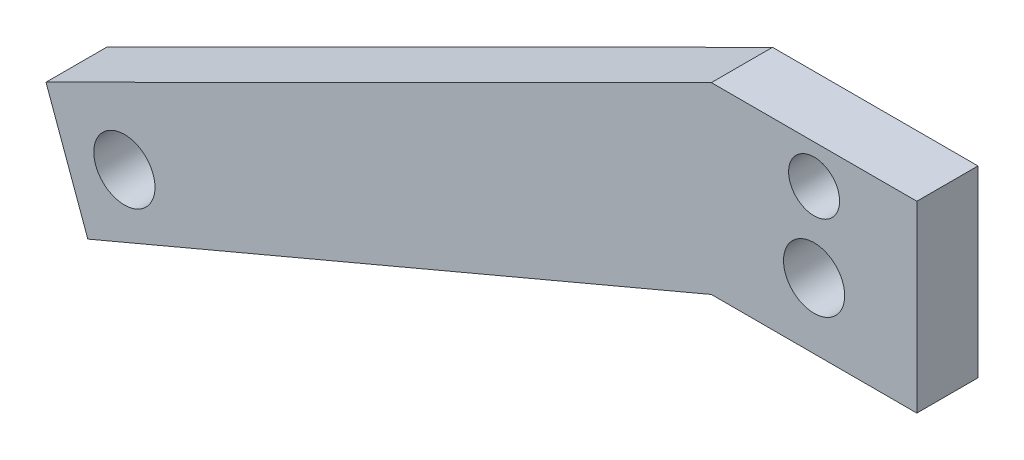
ISO-10303-21;
HEADER;
FILE_DESCRIPTION(('STEP AP214'),'2;1');
FILE_NAME('part.step','',(''),(''),'','','');
FILE_SCHEMA(('AUTOMOTIVE_DESIGN { 1 0 10303 214 1 1 1 1 }'));
ENDSEC;
DATA;
#1=APPLICATION_CONTEXT('core data for automotive mechanical design processes');
#2=APPLICATION_PROTOCOL_DEFINITION('international standard','automotive_design',2000,#1);
#3=PRODUCT_CONTEXT('',#1,'mechanical');
#4=PRODUCT('Part','Part','',(#3));
#5=PRODUCT_RELATED_PRODUCT_CATEGORY('part','',(#4));
#6=PRODUCT_DEFINITION_FORMATION('','',#4);
#7=PRODUCT_DEFINITION_CONTEXT('part definition',#1,'design');
#8=PRODUCT_DEFINITION('design','',#6,#7);
#9=PRODUCT_DEFINITION_SHAPE('','',#8);
#10=(LENGTH_UNIT() NAMED_UNIT(*) SI_UNIT(.MILLI.,.METRE.));
#11=(NAMED_UNIT(*) PLANE_ANGLE_UNIT() SI_UNIT($,.RADIAN.));
#12=(NAMED_UNIT(*) SI_UNIT($,.STERADIAN.) SOLID_ANGLE_UNIT());
#13=UNCERTAINTY_MEASURE_WITH_UNIT(LENGTH_MEASURE(1.E-05),#10,'distance_accuracy_value','');
#14=(GEOMETRIC_REPRESENTATION_CONTEXT(3) GLOBAL_UNCERTAINTY_ASSIGNED_CONTEXT((#13)) GLOBAL_UNIT_ASSIGNED_CONTEXT((#10,
#11,#12)) REPRESENTATION_CONTEXT('',''));
#15=CARTESIAN_POINT('',(0.,0.,0.));
#16=DIRECTION('',(0.,0.,1.));
#17=DIRECTION('',(1.,0.,0.));
#18=AXIS2_PLACEMENT_3D('',#15,#16,#17);
#19=CARTESIAN_POINT('',(-107.793068959156,-39.233468561337,9.525));
#20=DIRECTION('',(-0.939692620785908,-0.34202014332567,0.));
#21=DIRECTION('',(0.34202014332567,-0.939692620785908,0.));
#22=AXIS2_PLACEMENT_3D('',#19,#20,#21);
#23=PLANE('',#22);
#24=DIRECTION('',(-0.34202014332567,0.939692620785908,0.));
#25=VECTOR('',#24,1.);
#26=CARTESIAN_POINT('',(-107.793068959156,-39.233468561337,0.));
#27=LINE('',#26,#25);
#28=CARTESIAN_POINT('',(-113.099691567692,-24.6536427708158,0.));
#29=VERTEX_POINT('',#28);
#30=CARTESIAN_POINT('',(-119.615175298046,-6.75249834484423,0.));
#31=VERTEX_POINT('',#30);
#32=EDGE_CURVE('E144',#29,#31,#27,.T.);
#33=ORIENTED_EDGE('',*,*,#32,.F.);
#34=DIRECTION('',(0.,0.,-1.));
#35=VECTOR('',#34,1.);
#36=CARTESIAN_POINT('',(-113.099691567692,-24.6536427708158,9.525));
#37=LINE('',#36,#35);
#38=CARTESIAN_POINT('',(-113.099691567692,-24.6536427708158,9.525));
#39=VERTEX_POINT('',#38);
#40=EDGE_CURVE('E11',#39,#29,#37,.T.);
#41=ORIENTED_EDGE('',*,*,#40,.F.);
#42=DIRECTION('',(-0.34202014332567,0.939692620785908,0.));
#43=VECTOR('',#42,1.);
#44=CARTESIAN_POINT('',(-107.793068959156,-39.233468561337,9.525));
#45=LINE('',#44,#43);
#46=CARTESIAN_POINT('',(-119.615175298046,-6.75249834484423,9.525));
#47=VERTEX_POINT('',#46);
#48=EDGE_CURVE('E278',#39,#47,#45,.T.);
#49=ORIENTED_EDGE('',*,*,#48,.T.);
#50=DIRECTION('',(0.,0.,-1.));
#51=VECTOR('',#50,1.);
#52=CARTESIAN_POINT('',(-119.615175298046,-6.75249834484423,9.525));
#53=LINE('',#52,#51);
#54=EDGE_CURVE('E87',#47,#31,#53,.T.);
#55=ORIENTED_EDGE('',*,*,#54,.T.);
#56=EDGE_LOOP('',(#33,#41,#49,#55));
#57=FACE_BOUND('',#56,.T.);
#58=ADVANCED_FACE('F41',(#57),#23,.T.);
#59=CARTESIAN_POINT('',(-8.32273533976929,19.6728880173249,9.525));
#60=DIRECTION('',(0.389623727137633,-0.920974131695011,0.));
#61=DIRECTION('',(0.920974131695011,0.389623727137633,0.));
#62=AXIS2_PLACEMENT_3D('',#59,#60,#61);
#63=PLANE('',#62);
#64=DIRECTION('',(-0.920974131695011,-0.389623727137633,0.));
#65=VECTOR('',#64,1.);
#66=CARTESIAN_POINT('',(-8.32273533976929,19.6728880173249,0.));
#67=LINE('',#66,#65);
#68=CARTESIAN_POINT('',(-15.9999946271166,16.4249766213414,0.));
#69=VERTEX_POINT('',#68);
#70=EDGE_CURVE('E141',#69,#29,#67,.T.);
#71=ORIENTED_EDGE('',*,*,#70,.F.);
#72=DIRECTION('',(0.,0.,-1.));
#73=VECTOR('',#72,1.);
#74=CARTESIAN_POINT('',(-15.9999946271166,16.4249766213414,9.525));
#75=LINE('',#74,#73);
#76=CARTESIAN_POINT('',(-15.9999946271166,16.4249766213414,9.525));
#77=VERTEX_POINT('',#76);
#78=EDGE_CURVE('E51',#77,#69,#75,.T.);
#79=ORIENTED_EDGE('',*,*,#78,.F.);
#80=DIRECTION('',(-0.920974131695011,-0.389623727137633,0.));
#81=VECTOR('',#80,1.);
#82=CARTESIAN_POINT('',(-8.32273533976929,19.6728880173249,9.525));
#83=LINE('',#82,#81);
#84=EDGE_CURVE('E280',#77,#39,#83,.T.);
#85=ORIENTED_EDGE('',*,*,#84,.T.);
#86=ORIENTED_EDGE('',*,*,#40,.T.);
#87=EDGE_LOOP('',(#71,#79,#85,#86));
#88=FACE_BOUND('',#87,.T.);
#89=ADVANCED_FACE('F142',(#88),#63,.T.);
#90=CARTESIAN_POINT('',(0.,16.4249766213414,9.525));
#91=DIRECTION('',(0.,-1.,0.));
#92=DIRECTION('',(0.,0.,-1.));
#93=AXIS2_PLACEMENT_3D('',#90,#91,#92);
#94=PLANE('',#93);
#95=DIRECTION('',(-1.,0.,0.));
#96=VECTOR('',#95,1.);
#97=CARTESIAN_POINT('',(0.,16.4249766213414,0.));
#98=LINE('',#97,#96);
#99=CARTESIAN_POINT('',(16.0000053728835,16.4249766213414,0.));
#100=VERTEX_POINT('',#99);
#101=EDGE_CURVE('E137',#100,#69,#98,.T.);
#102=ORIENTED_EDGE('',*,*,#101,.F.);
#103=DIRECTION('',(0.,0.,-1.));
#104=VECTOR('',#103,1.);
#105=CARTESIAN_POINT('',(16.0000053728835,16.4249766213414,9.525));
#106=LINE('',#105,#104);
#107=CARTESIAN_POINT('',(16.0000053728835,16.4249766213414,9.525));
#108=VERTEX_POINT('',#107);
#109=EDGE_CURVE('E124',#108,#100,#106,.T.);
#110=ORIENTED_EDGE('',*,*,#109,.F.);
#111=DIRECTION('',(-1.,0.,0.));
#112=VECTOR('',#111,1.);
#113=CARTESIAN_POINT('',(0.,16.4249766213414,9.525));
#114=LINE('',#113,#112);
#115=EDGE_CURVE('E116',#108,#77,#114,.T.);
#116=ORIENTED_EDGE('',*,*,#115,.T.);
#117=ORIENTED_EDGE('',*,*,#78,.T.);
#118=EDGE_LOOP('',(#102,#110,#116,#117));
#119=FACE_BOUND('',#118,.T.);
#120=ADVANCED_FACE('F135',(#119),#94,.T.);
#121=CARTESIAN_POINT('',(16.0000053728834,0.,9.525));
#122=DIRECTION('',(-1.,0.,0.));
#123=DIRECTION('',(0.,-1.,0.));
#124=AXIS2_PLACEMENT_3D('',#121,#122,#123);
#125=PLANE('',#124);
#126=DIRECTION('',(0.,1.,0.));
#127=VECTOR('',#126,1.);
#128=CARTESIAN_POINT('',(16.0000053728834,0.,0.));
#129=LINE('',#128,#127);
#130=CARTESIAN_POINT('',(16.0000053728835,44.9999766213416,0.));
#131=VERTEX_POINT('',#130);
#132=EDGE_CURVE('E122',#100,#131,#129,.T.);
#133=ORIENTED_EDGE('',*,*,#132,.T.);
#134=DIRECTION('',(0.,0.,-1.));
#135=VECTOR('',#134,1.);
#136=CARTESIAN_POINT('',(16.0000053728835,44.9999766213416,9.525));
#137=LINE('',#136,#135);
#138=CARTESIAN_POINT('',(16.0000053728835,44.9999766213416,9.525));
#139=VERTEX_POINT('',#138);
#140=EDGE_CURVE('E105',#139,#131,#137,.T.);
#141=ORIENTED_EDGE('',*,*,#140,.F.);
#142=DIRECTION('',(0.,1.,0.));
#143=VECTOR('',#142,1.);
#144=CARTESIAN_POINT('',(16.0000053728834,0.,9.525));
#145=LINE('',#144,#143);
#146=EDGE_CURVE('E109',#108,#139,#145,.T.);
#147=ORIENTED_EDGE('',*,*,#146,.F.);
#148=ORIENTED_EDGE('',*,*,#109,.T.);
#149=EDGE_LOOP('',(#133,#141,#147,#148));
#150=FACE_BOUND('',#149,.T.);
#151=ADVANCED_FACE('F120',(#150),#125,.F.);
#152=CARTESIAN_POINT('',(0.,44.9999766213416,9.525));
#153=DIRECTION('',(0.,-1.,0.));
#154=DIRECTION('',(1.,0.,0.));
#155=AXIS2_PLACEMENT_3D('',#152,#153,#154);
#156=PLANE('',#155);
#157=DIRECTION('',(-1.,0.,0.));
#158=VECTOR('',#157,1.);
#159=CARTESIAN_POINT('',(0.,44.9999766213416,0.));
#160=LINE('',#159,#158);
#161=CARTESIAN_POINT('',(-15.9999946271165,44.9999766213416,0.));
#162=VERTEX_POINT('',#161);
#163=EDGE_CURVE('E150',#131,#162,#160,.T.);
#164=ORIENTED_EDGE('',*,*,#163,.T.);
#165=DIRECTION('',(0.,0.,-1.));
#166=VECTOR('',#165,1.);
#167=CARTESIAN_POINT('',(-15.9999946271165,44.9999766213416,9.525));
#168=LINE('',#167,#166);
#169=CARTESIAN_POINT('',(-15.9999946271165,44.9999766213416,9.525));
#170=VERTEX_POINT('',#169);
#171=EDGE_CURVE('E107',#170,#162,#168,.T.);
#172=ORIENTED_EDGE('',*,*,#171,.F.);
#173=DIRECTION('',(-1.,0.,0.));
#174=VECTOR('',#173,1.);
#175=CARTESIAN_POINT('',(0.,44.9999766213416,9.525));
#176=LINE('',#175,#174);
#177=EDGE_CURVE('E100',#139,#170,#176,.T.);
#178=ORIENTED_EDGE('',*,*,#177,.F.);
#179=ORIENTED_EDGE('',*,*,#140,.T.);
#180=EDGE_LOOP('',(#164,#172,#178,#179));
#181=FACE_BOUND('',#180,.T.);
#182=ADVANCED_FACE('F103',(#181),#156,.F.);
#183=CARTESIAN_POINT('',(5.37288354793729E-06,38.9999766213416,9.525));
#184=DIRECTION('',(0.,0.,-1.));
#185=DIRECTION('',(-1.,0.,0.));
#186=AXIS2_PLACEMENT_3D('',#183,#184,#185);
#187=CYLINDRICAL_SURFACE('',#186,3.96875000217001);
#188=CARTESIAN_POINT('',(5.37288354793729E-06,38.9999766213416,9.525));
#189=DIRECTION('',(0.,0.,1.));
#190=DIRECTION('',(1.,0.,0.));
#191=AXIS2_PLACEMENT_3D('',#188,#189,#190);
#192=CIRCLE('',#191,3.96875000217001);
#193=CARTESIAN_POINT('',(3.96875537505355,38.9999766213416,9.525));
#194=VERTEX_POINT('',#193);
#195=EDGE_CURVE('E281',#194,#194,#192,.T.);
#196=ORIENTED_EDGE('',*,*,#195,.T.);
#197=EDGE_LOOP('',(#196));
#198=FACE_BOUND('',#197,.T.);
#199=CARTESIAN_POINT('',(5.37288354793729E-06,38.9999766213416,0.));
#200=DIRECTION('',(0.,0.,1.));
#201=DIRECTION('',(1.,0.,0.));
#202=AXIS2_PLACEMENT_3D('',#199,#200,#201);
#203=CIRCLE('',#202,3.96875000217001);
#204=CARTESIAN_POINT('',(3.96875537505355,38.9999766213416,0.));
#205=VERTEX_POINT('',#204);
#206=EDGE_CURVE('E170',#205,#205,#203,.T.);
#207=ORIENTED_EDGE('',*,*,#206,.F.);
#208=EDGE_LOOP('',(#207));
#209=FACE_BOUND('',#208,.T.);
#210=ADVANCED_FACE('F182',(#198,#209),#187,.F.);
#211=CARTESIAN_POINT('',(5.3359456523433E-06,26.647573689471,9.525));
#212=DIRECTION('',(0.,0.,-1.));
#213=DIRECTION('',(-1.,0.,0.));
#214=AXIS2_PLACEMENT_3D('',#211,#212,#213);
#215=CYLINDRICAL_SURFACE('',#214,4.76250000164186);
#216=CARTESIAN_POINT('',(5.3359456523433E-06,26.647573689471,9.525));
#217=DIRECTION('',(0.,0.,1.));
#218=DIRECTION('',(1.,0.,0.));
#219=AXIS2_PLACEMENT_3D('',#216,#217,#218);
#220=CIRCLE('',#219,4.76250000164186);
#221=CARTESIAN_POINT('',(4.76250533758751,26.647573689471,9.525));
#222=VERTEX_POINT('',#221);
#223=EDGE_CURVE('E196',#222,#222,#220,.T.);
#224=ORIENTED_EDGE('',*,*,#223,.T.);
#225=EDGE_LOOP('',(#224));
#226=FACE_BOUND('',#225,.T.);
#227=CARTESIAN_POINT('',(5.3359456523433E-06,26.647573689471,0.));
#228=DIRECTION('',(0.,0.,1.));
#229=DIRECTION('',(1.,0.,0.));
#230=AXIS2_PLACEMENT_3D('',#227,#228,#229);
#231=CIRCLE('',#230,4.76250000164186);
#232=CARTESIAN_POINT('',(4.76250533758751,26.647573689471,0.));
#233=VERTEX_POINT('',#232);
#234=EDGE_CURVE('E166',#233,#233,#231,.T.);
#235=ORIENTED_EDGE('',*,*,#234,.F.);
#236=EDGE_LOOP('',(#235));
#237=FACE_BOUND('',#236,.T.);
#238=ADVANCED_FACE('F184',(#226,#237),#215,.F.);
#239=CARTESIAN_POINT('',(-107.406861219884,-12.445328692653,9.525));
#240=DIRECTION('',(0.,0.,-1.));
#241=DIRECTION('',(-1.,0.,0.));
#242=AXIS2_PLACEMENT_3D('',#239,#240,#241);
#243=CYLINDRICAL_SURFACE('',#242,4.76250000164186);
#244=CARTESIAN_POINT('',(-107.406861219884,-12.445328692653,9.525));
#245=DIRECTION('',(0.,0.,1.));
#246=DIRECTION('',(1.,0.,0.));
#247=AXIS2_PLACEMENT_3D('',#244,#245,#246);
#248=CIRCLE('',#247,4.76250000164186);
#249=CARTESIAN_POINT('',(-102.644361218242,-12.445328692653,9.525));
#250=VERTEX_POINT('',#249);
#251=EDGE_CURVE('E157',#250,#250,#248,.T.);
#252=ORIENTED_EDGE('',*,*,#251,.T.);
#253=EDGE_LOOP('',(#252));
#254=FACE_BOUND('',#253,.T.);
#255=CARTESIAN_POINT('',(-107.406861219884,-12.445328692653,0.));
#256=DIRECTION('',(0.,0.,1.));
#257=DIRECTION('',(1.,0.,0.));
#258=AXIS2_PLACEMENT_3D('',#255,#256,#257);
#259=CIRCLE('',#258,4.76250000164186);
#260=CARTESIAN_POINT('',(-102.644361218242,-12.445328692653,0.));
#261=VERTEX_POINT('',#260);
#262=EDGE_CURVE('E162',#261,#261,#259,.T.);
#263=ORIENTED_EDGE('',*,*,#262,.F.);
#264=EDGE_LOOP('',(#263));
#265=FACE_BOUND('',#264,.T.);
#266=ADVANCED_FACE('F43',(#254,#265),#243,.F.);
#267=CARTESIAN_POINT('',(-21.1830447475682,42.4112085482631,9.525));
#268=DIRECTION('',(0.446832860415787,-0.894617457270227,0.));
#269=DIRECTION('',(0.894617457270227,0.446832860415787,0.));
#270=AXIS2_PLACEMENT_3D('',#267,#268,#269);
#271=PLANE('',#270);
#272=DIRECTION('',(-0.894617457270227,-0.446832860415787,0.));
#273=VECTOR('',#272,1.);
#274=CARTESIAN_POINT('',(-21.1830447475682,42.4112085482631,0.));
#275=LINE('',#274,#273);
#276=EDGE_CURVE('E80',#162,#31,#275,.T.);
#277=ORIENTED_EDGE('',*,*,#276,.T.);
#278=ORIENTED_EDGE('',*,*,#54,.F.);
#279=DIRECTION('',(-0.894617457270227,-0.446832860415787,0.));
#280=VECTOR('',#279,1.);
#281=CARTESIAN_POINT('',(-21.1830447475682,42.4112085482631,9.525));
#282=LINE('',#281,#280);
#283=EDGE_CURVE('E59',#170,#47,#282,.T.);
#284=ORIENTED_EDGE('',*,*,#283,.F.);
#285=ORIENTED_EDGE('',*,*,#171,.T.);
#286=EDGE_LOOP('',(#277,#278,#284,#285));
#287=FACE_BOUND('',#286,.T.);
#288=ADVANCED_FACE('F191',(#287),#271,.F.);
#289=CARTESIAN_POINT('',(0.,0.,9.525));
#290=DIRECTION('',(0.,0.,1.));
#291=DIRECTION('',(1.,0.,0.));
#292=AXIS2_PLACEMENT_3D('',#289,#290,#291);
#293=PLANE('',#292);
#294=ORIENTED_EDGE('',*,*,#251,.F.);
#295=EDGE_LOOP('',(#294));
#296=FACE_BOUND('',#295,.T.);
#297=ORIENTED_EDGE('',*,*,#223,.F.);
#298=EDGE_LOOP('',(#297));
#299=FACE_BOUND('',#298,.T.);
#300=ORIENTED_EDGE('',*,*,#195,.F.);
#301=EDGE_LOOP('',(#300));
#302=FACE_BOUND('',#301,.T.);
#303=ORIENTED_EDGE('',*,*,#48,.F.);
#304=ORIENTED_EDGE('',*,*,#84,.F.);
#305=ORIENTED_EDGE('',*,*,#115,.F.);
#306=ORIENTED_EDGE('',*,*,#146,.T.);
#307=ORIENTED_EDGE('',*,*,#177,.T.);
#308=ORIENTED_EDGE('',*,*,#283,.T.);
#309=EDGE_LOOP('',(#303,#304,#305,#306,#307,#308));
#310=FACE_BOUND('',#309,.T.);
#311=ADVANCED_FACE('F113',(#296,#299,#302,#310),#293,.T.);
#312=CARTESIAN_POINT('',(0.,0.,0.));
#313=DIRECTION('',(0.,0.,1.));
#314=DIRECTION('',(1.,0.,0.));
#315=AXIS2_PLACEMENT_3D('',#312,#313,#314);
#316=PLANE('',#315);
#317=ORIENTED_EDGE('',*,*,#262,.T.);
#318=EDGE_LOOP('',(#317));
#319=FACE_BOUND('',#318,.T.);
#320=ORIENTED_EDGE('',*,*,#234,.T.);
#321=EDGE_LOOP('',(#320));
#322=FACE_BOUND('',#321,.T.);
#323=ORIENTED_EDGE('',*,*,#206,.T.);
#324=EDGE_LOOP('',(#323));
#325=FACE_BOUND('',#324,.T.);
#326=ORIENTED_EDGE('',*,*,#32,.T.);
#327=ORIENTED_EDGE('',*,*,#276,.F.);
#328=ORIENTED_EDGE('',*,*,#163,.F.);
#329=ORIENTED_EDGE('',*,*,#132,.F.);
#330=ORIENTED_EDGE('',*,*,#101,.T.);
#331=ORIENTED_EDGE('',*,*,#70,.T.);
#332=EDGE_LOOP('',(#326,#327,#328,#329,#330,#331));
#333=FACE_BOUND('',#332,.T.);
#334=ADVANCED_FACE('F146',(#319,#322,#325,#333),#316,.F.);
#335=CLOSED_SHELL('',(#58,#89,#120,#151,#182,#210,#238,#266,#288,#311,#334));
#336=MANIFOLD_SOLID_BREP('B2',#335);
#337=ADVANCED_BREP_SHAPE_REPRESENTATION('',(#18,#336),#14);
#338=SHAPE_DEFINITION_REPRESENTATION(#9,#337);
ENDSEC;
END-ISO-10303-21;
